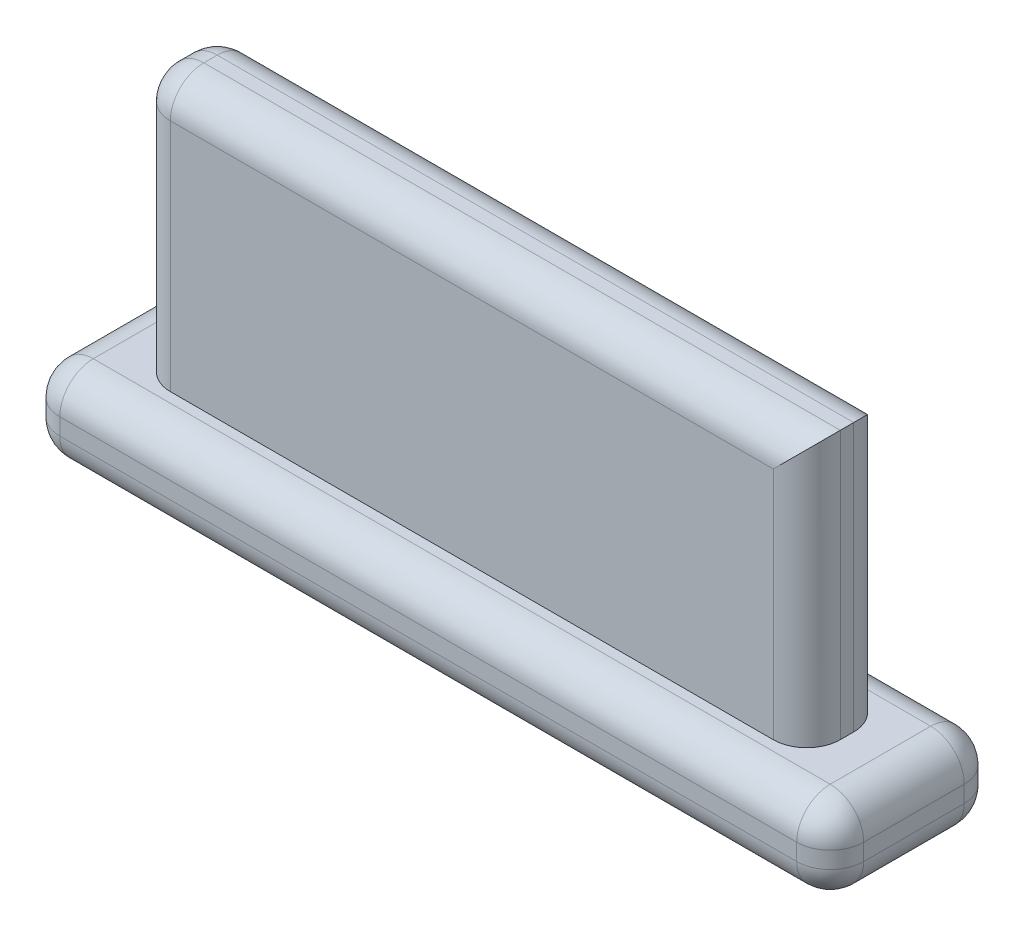
ISO-10303-21;
HEADER;
FILE_DESCRIPTION(('STEP AP214'),'2;1');
FILE_NAME('part.step','',(''),(''),'','','');
FILE_SCHEMA(('AUTOMOTIVE_DESIGN { 1 0 10303 214 1 1 1 1 }'));
ENDSEC;
DATA;
#1=APPLICATION_CONTEXT('core data for automotive mechanical design processes');
#2=APPLICATION_PROTOCOL_DEFINITION('international standard','automotive_design',2000,#1);
#3=PRODUCT_CONTEXT('',#1,'mechanical');
#4=PRODUCT('Part','Part','',(#3));
#5=PRODUCT_RELATED_PRODUCT_CATEGORY('part','',(#4));
#6=PRODUCT_DEFINITION_FORMATION('','',#4);
#7=PRODUCT_DEFINITION_CONTEXT('part definition',#1,'design');
#8=PRODUCT_DEFINITION('design','',#6,#7);
#9=PRODUCT_DEFINITION_SHAPE('','',#8);
#10=(LENGTH_UNIT() NAMED_UNIT(*) SI_UNIT(.MILLI.,.METRE.));
#11=(NAMED_UNIT(*) PLANE_ANGLE_UNIT() SI_UNIT($,.RADIAN.));
#12=(NAMED_UNIT(*) SI_UNIT($,.STERADIAN.) SOLID_ANGLE_UNIT());
#13=UNCERTAINTY_MEASURE_WITH_UNIT(LENGTH_MEASURE(1.E-05),#10,'distance_accuracy_value','');
#14=(GEOMETRIC_REPRESENTATION_CONTEXT(3) GLOBAL_UNCERTAINTY_ASSIGNED_CONTEXT((#13)) GLOBAL_UNIT_ASSIGNED_CONTEXT((#10,
#11,#12)) REPRESENTATION_CONTEXT('',''));
#15=CARTESIAN_POINT('',(0.,0.,0.));
#16=DIRECTION('',(0.,0.,1.));
#17=DIRECTION('',(1.,0.,0.));
#18=AXIS2_PLACEMENT_3D('',#15,#16,#17);
#19=CARTESIAN_POINT('',(12.7,10.16,1.524));
#20=DIRECTION('',(-1.,0.,0.));
#21=DIRECTION('',(0.,0.,1.));
#22=AXIS2_PLACEMENT_3D('',#19,#20,#21);
#23=PLANE('',#22);
#24=DIRECTION('',(0.,0.,-1.));
#25=VECTOR('',#24,1.);
#26=CARTESIAN_POINT('',(12.7,0.,1.524));
#27=LINE('',#26,#25);
#28=CARTESIAN_POINT('',(12.7,0.,0.254));
#29=VERTEX_POINT('',#28);
#30=CARTESIAN_POINT('',(12.7,0.,-0.254));
#31=VERTEX_POINT('',#30);
#32=EDGE_CURVE('E254',#29,#31,#27,.T.);
#33=ORIENTED_EDGE('',*,*,#32,.T.);
#34=DIRECTION('',(0.,-1.,0.));
#35=VECTOR('',#34,1.);
#36=CARTESIAN_POINT('',(12.7,10.16,-0.254));
#37=LINE('',#36,#35);
#38=CARTESIAN_POINT('',(12.7,10.16,-0.254));
#39=VERTEX_POINT('',#38);
#40=EDGE_CURVE('E383',#31,#39,#37,.F.);
#41=ORIENTED_EDGE('',*,*,#40,.T.);
#42=DIRECTION('',(0.,0.,-1.));
#43=VECTOR('',#42,1.);
#44=CARTESIAN_POINT('',(12.7,10.16,1.524));
#45=LINE('',#44,#43);
#46=CARTESIAN_POINT('',(12.7,10.16,0.254));
#47=VERTEX_POINT('',#46);
#48=EDGE_CURVE('E198',#47,#39,#45,.T.);
#49=ORIENTED_EDGE('',*,*,#48,.F.);
#50=DIRECTION('',(0.,-1.,0.));
#51=VECTOR('',#50,1.);
#52=CARTESIAN_POINT('',(12.7,10.16,0.254));
#53=LINE('',#52,#51);
#54=EDGE_CURVE('E381',#47,#29,#53,.T.);
#55=ORIENTED_EDGE('',*,*,#54,.T.);
#56=EDGE_LOOP('',(#33,#41,#49,#55));
#57=FACE_BOUND('',#56,.T.);
#58=ADVANCED_FACE('F33',(#57),#23,.F.);
#59=CARTESIAN_POINT('',(-12.7,10.16,-1.524));
#60=DIRECTION('',(0.,0.,1.));
#61=DIRECTION('',(1.,0.,0.));
#62=AXIS2_PLACEMENT_3D('',#59,#60,#61);
#63=PLANE('',#62);
#64=DIRECTION('',(-1.,0.,0.));
#65=VECTOR('',#64,1.);
#66=CARTESIAN_POINT('',(-12.7,0.,-1.524));
#67=LINE('',#66,#65);
#68=CARTESIAN_POINT('',(11.43,0.,-1.524));
#69=VERTEX_POINT('',#68);
#70=CARTESIAN_POINT('',(-11.43,0.,-1.524));
#71=VERTEX_POINT('',#70);
#72=EDGE_CURVE('E395',#69,#71,#67,.T.);
#73=ORIENTED_EDGE('',*,*,#72,.T.);
#74=DIRECTION('',(0.,-1.,0.));
#75=VECTOR('',#74,1.);
#76=CARTESIAN_POINT('',(-11.43,10.16,-1.524));
#77=LINE('',#76,#75);
#78=CARTESIAN_POINT('',(-11.43,8.89,-1.524));
#79=VERTEX_POINT('',#78);
#80=EDGE_CURVE('E55',#71,#79,#77,.F.);
#81=ORIENTED_EDGE('',*,*,#80,.T.);
#82=DIRECTION('',(-1.,0.,0.));
#83=VECTOR('',#82,1.);
#84=CARTESIAN_POINT('',(-12.7,8.89,-1.524));
#85=LINE('',#84,#83);
#86=CARTESIAN_POINT('',(11.43,8.89,-1.524));
#87=VERTEX_POINT('',#86);
#88=EDGE_CURVE('E50',#79,#87,#85,.F.);
#89=ORIENTED_EDGE('',*,*,#88,.T.);
#90=DIRECTION('',(0.,-1.,0.));
#91=VECTOR('',#90,1.);
#92=CARTESIAN_POINT('',(11.43,10.16,-1.524));
#93=LINE('',#92,#91);
#94=EDGE_CURVE('E378',#87,#69,#93,.T.);
#95=ORIENTED_EDGE('',*,*,#94,.T.);
#96=EDGE_LOOP('',(#73,#81,#89,#95));
#97=FACE_BOUND('',#96,.T.);
#98=ADVANCED_FACE('F459',(#97),#63,.F.);
#99=CARTESIAN_POINT('',(-12.7,10.16,1.524));
#100=DIRECTION('',(1.,0.,0.));
#101=DIRECTION('',(0.,0.,-1.));
#102=AXIS2_PLACEMENT_3D('',#99,#100,#101);
#103=PLANE('',#102);
#104=DIRECTION('',(0.,0.,1.));
#105=VECTOR('',#104,1.);
#106=CARTESIAN_POINT('',(-12.7,8.89,1.524));
#107=LINE('',#106,#105);
#108=CARTESIAN_POINT('',(-12.7,8.89,0.254));
#109=VERTEX_POINT('',#108);
#110=CARTESIAN_POINT('',(-12.7,8.89,-0.254));
#111=VERTEX_POINT('',#110);
#112=EDGE_CURVE('E371',#109,#111,#107,.F.);
#113=ORIENTED_EDGE('',*,*,#112,.T.);
#114=DIRECTION('',(0.,-1.,0.));
#115=VECTOR('',#114,1.);
#116=CARTESIAN_POINT('',(-12.7,10.16,-0.254));
#117=LINE('',#116,#115);
#118=CARTESIAN_POINT('',(-12.7,0.,-0.254));
#119=VERTEX_POINT('',#118);
#120=EDGE_CURVE('E375',#111,#119,#117,.T.);
#121=ORIENTED_EDGE('',*,*,#120,.T.);
#122=DIRECTION('',(0.,0.,1.));
#123=VECTOR('',#122,1.);
#124=CARTESIAN_POINT('',(-12.7,0.,1.524));
#125=LINE('',#124,#123);
#126=CARTESIAN_POINT('',(-12.7,0.,0.254));
#127=VERTEX_POINT('',#126);
#128=EDGE_CURVE('E413',#119,#127,#125,.T.);
#129=ORIENTED_EDGE('',*,*,#128,.T.);
#130=DIRECTION('',(0.,-1.,0.));
#131=VECTOR('',#130,1.);
#132=CARTESIAN_POINT('',(-12.7,10.16,0.254));
#133=LINE('',#132,#131);
#134=EDGE_CURVE('E373',#127,#109,#133,.F.);
#135=ORIENTED_EDGE('',*,*,#134,.T.);
#136=EDGE_LOOP('',(#113,#121,#129,#135));
#137=FACE_BOUND('',#136,.T.);
#138=ADVANCED_FACE('F464',(#137),#103,.F.);
#139=CARTESIAN_POINT('',(-12.7,10.16,1.524));
#140=DIRECTION('',(0.,0.,-1.));
#141=DIRECTION('',(-1.,0.,0.));
#142=AXIS2_PLACEMENT_3D('',#139,#140,#141);
#143=PLANE('',#142);
#144=DIRECTION('',(1.,0.,0.));
#145=VECTOR('',#144,1.);
#146=CARTESIAN_POINT('',(-12.7,8.89,1.524));
#147=LINE('',#146,#145);
#148=CARTESIAN_POINT('',(11.43,8.89,1.524));
#149=VERTEX_POINT('',#148);
#150=CARTESIAN_POINT('',(-11.43,8.89,1.524));
#151=VERTEX_POINT('',#150);
#152=EDGE_CURVE('E367',#149,#151,#147,.F.);
#153=ORIENTED_EDGE('',*,*,#152,.T.);
#154=DIRECTION('',(0.,-1.,0.));
#155=VECTOR('',#154,1.);
#156=CARTESIAN_POINT('',(-11.43,10.16,1.524));
#157=LINE('',#156,#155);
#158=CARTESIAN_POINT('',(-11.43,0.,1.524));
#159=VERTEX_POINT('',#158);
#160=EDGE_CURVE('E369',#151,#159,#157,.T.);
#161=ORIENTED_EDGE('',*,*,#160,.T.);
#162=DIRECTION('',(1.,0.,0.));
#163=VECTOR('',#162,1.);
#164=CARTESIAN_POINT('',(-12.7,0.,1.524));
#165=LINE('',#164,#163);
#166=CARTESIAN_POINT('',(11.43,0.,1.524));
#167=VERTEX_POINT('',#166);
#168=EDGE_CURVE('E410',#159,#167,#165,.T.);
#169=ORIENTED_EDGE('',*,*,#168,.T.);
#170=DIRECTION('',(0.,-1.,0.));
#171=VECTOR('',#170,1.);
#172=CARTESIAN_POINT('',(11.43,10.16,1.524));
#173=LINE('',#172,#171);
#174=EDGE_CURVE('E365',#167,#149,#173,.F.);
#175=ORIENTED_EDGE('',*,*,#174,.T.);
#176=EDGE_LOOP('',(#153,#161,#169,#175));
#177=FACE_BOUND('',#176,.T.);
#178=ADVANCED_FACE('F469',(#177),#143,.F.);
#179=CARTESIAN_POINT('',(0.,10.16,0.));
#180=DIRECTION('',(0.,-1.,0.));
#181=DIRECTION('',(0.,0.,-1.));
#182=AXIS2_PLACEMENT_3D('',#179,#180,#181);
#183=PLANE('',#182);
#184=DIRECTION('',(0.,0.,1.));
#185=VECTOR('',#184,1.);
#186=CARTESIAN_POINT('',(-11.43,10.16,0.));
#187=LINE('',#186,#185);
#188=CARTESIAN_POINT('',(-11.43,10.16,-0.254));
#189=VERTEX_POINT('',#188);
#190=CARTESIAN_POINT('',(-11.43,10.16,0.254));
#191=VERTEX_POINT('',#190);
#192=EDGE_CURVE('E358',#189,#191,#187,.T.);
#193=ORIENTED_EDGE('',*,*,#192,.T.);
#194=DIRECTION('',(1.,0.,0.));
#195=VECTOR('',#194,1.);
#196=CARTESIAN_POINT('',(0.,10.16,0.254));
#197=LINE('',#196,#195);
#198=EDGE_CURVE('E362',#191,#47,#197,.T.);
#199=ORIENTED_EDGE('',*,*,#198,.T.);
#200=ORIENTED_EDGE('',*,*,#48,.T.);
#201=DIRECTION('',(-1.,0.,0.));
#202=VECTOR('',#201,1.);
#203=CARTESIAN_POINT('',(0.,10.16,-0.254));
#204=LINE('',#203,#202);
#205=EDGE_CURVE('E360',#39,#189,#204,.T.);
#206=ORIENTED_EDGE('',*,*,#205,.T.);
#207=EDGE_LOOP('',(#193,#199,#200,#206));
#208=FACE_BOUND('',#207,.T.);
#209=ADVANCED_FACE('F406',(#208),#183,.F.);
#210=CARTESIAN_POINT('',(15.24,-3.175,3.175));
#211=DIRECTION('',(-1.,0.,0.));
#212=DIRECTION('',(0.,0.,1.));
#213=AXIS2_PLACEMENT_3D('',#210,#211,#212);
#214=PLANE('',#213);
#215=DIRECTION('',(0.,1.,0.));
#216=VECTOR('',#215,1.);
#217=CARTESIAN_POINT('',(15.24,-3.175,1.905));
#218=LINE('',#217,#216);
#219=CARTESIAN_POINT('',(15.24,-1.27,1.905));
#220=VERTEX_POINT('',#219);
#221=CARTESIAN_POINT('',(15.24,-1.905,1.905));
#222=VERTEX_POINT('',#221);
#223=EDGE_CURVE('E336',#220,#222,#218,.F.);
#224=ORIENTED_EDGE('',*,*,#223,.T.);
#225=DIRECTION('',(0.,0.,1.));
#226=VECTOR('',#225,1.);
#227=CARTESIAN_POINT('',(15.24,-1.905,-3.175));
#228=LINE('',#227,#226);
#229=CARTESIAN_POINT('',(15.24,-1.905,-1.905));
#230=VERTEX_POINT('',#229);
#231=EDGE_CURVE('E338',#222,#230,#228,.F.);
#232=ORIENTED_EDGE('',*,*,#231,.T.);
#233=DIRECTION('',(0.,1.,0.));
#234=VECTOR('',#233,1.);
#235=CARTESIAN_POINT('',(15.24,-3.175,-1.905));
#236=LINE('',#235,#234);
#237=CARTESIAN_POINT('',(15.24,-1.27,-1.905));
#238=VERTEX_POINT('',#237);
#239=EDGE_CURVE('E332',#230,#238,#236,.T.);
#240=ORIENTED_EDGE('',*,*,#239,.T.);
#241=DIRECTION('',(0.,0.,1.));
#242=VECTOR('',#241,1.);
#243=CARTESIAN_POINT('',(15.24,-1.27,3.175));
#244=LINE('',#243,#242);
#245=EDGE_CURVE('E334',#238,#220,#244,.T.);
#246=ORIENTED_EDGE('',*,*,#245,.T.);
#247=EDGE_LOOP('',(#224,#232,#240,#246));
#248=FACE_BOUND('',#247,.T.);
#249=ADVANCED_FACE('F425',(#248),#214,.F.);
#250=CARTESIAN_POINT('',(-15.24,-3.175,3.175));
#251=DIRECTION('',(0.,0.,-1.));
#252=DIRECTION('',(-1.,0.,0.));
#253=AXIS2_PLACEMENT_3D('',#250,#251,#252);
#254=PLANE('',#253);
#255=DIRECTION('',(-1.,0.,0.));
#256=VECTOR('',#255,1.);
#257=CARTESIAN_POINT('',(15.24,-1.905,3.175));
#258=LINE('',#257,#256);
#259=CARTESIAN_POINT('',(-13.97,-1.905,3.175));
#260=VERTEX_POINT('',#259);
#261=CARTESIAN_POINT('',(13.97,-1.905,3.175));
#262=VERTEX_POINT('',#261);
#263=EDGE_CURVE('E313',#260,#262,#258,.F.);
#264=ORIENTED_EDGE('',*,*,#263,.T.);
#265=DIRECTION('',(0.,1.,0.));
#266=VECTOR('',#265,1.);
#267=CARTESIAN_POINT('',(13.97,-3.175,3.175));
#268=LINE('',#267,#266);
#269=CARTESIAN_POINT('',(13.97,-1.27,3.175));
#270=VERTEX_POINT('',#269);
#271=EDGE_CURVE('E306',#262,#270,#268,.T.);
#272=ORIENTED_EDGE('',*,*,#271,.T.);
#273=DIRECTION('',(-1.,0.,0.));
#274=VECTOR('',#273,1.);
#275=CARTESIAN_POINT('',(-15.24,-1.27,3.175));
#276=LINE('',#275,#274);
#277=CARTESIAN_POINT('',(-13.97,-1.27,3.175));
#278=VERTEX_POINT('',#277);
#279=EDGE_CURVE('E319',#270,#278,#276,.T.);
#280=ORIENTED_EDGE('',*,*,#279,.T.);
#281=DIRECTION('',(0.,1.,0.));
#282=VECTOR('',#281,1.);
#283=CARTESIAN_POINT('',(-13.97,-3.175,3.175));
#284=LINE('',#283,#282);
#285=EDGE_CURVE('E317',#278,#260,#284,.F.);
#286=ORIENTED_EDGE('',*,*,#285,.T.);
#287=EDGE_LOOP('',(#264,#272,#280,#286));
#288=FACE_BOUND('',#287,.T.);
#289=ADVANCED_FACE('F315',(#288),#254,.F.);
#290=CARTESIAN_POINT('',(-15.24,-3.175,3.175));
#291=DIRECTION('',(1.,0.,0.));
#292=DIRECTION('',(0.,0.,-1.));
#293=AXIS2_PLACEMENT_3D('',#290,#291,#292);
#294=PLANE('',#293);
#295=DIRECTION('',(0.,0.,-1.));
#296=VECTOR('',#295,1.);
#297=CARTESIAN_POINT('',(-15.24,-1.905,3.175));
#298=LINE('',#297,#296);
#299=CARTESIAN_POINT('',(-15.24,-1.905,-1.905));
#300=VERTEX_POINT('',#299);
#301=CARTESIAN_POINT('',(-15.24,-1.905,1.905));
#302=VERTEX_POINT('',#301);
#303=EDGE_CURVE('E209',#300,#302,#298,.F.);
#304=ORIENTED_EDGE('',*,*,#303,.T.);
#305=DIRECTION('',(0.,1.,0.));
#306=VECTOR('',#305,1.);
#307=CARTESIAN_POINT('',(-15.24,-3.175,1.905));
#308=LINE('',#307,#306);
#309=CARTESIAN_POINT('',(-15.24,-1.27,1.905));
#310=VERTEX_POINT('',#309);
#311=EDGE_CURVE('E346',#302,#310,#308,.T.);
#312=ORIENTED_EDGE('',*,*,#311,.T.);
#313=DIRECTION('',(0.,0.,-1.));
#314=VECTOR('',#313,1.);
#315=CARTESIAN_POINT('',(-15.24,-1.27,3.175));
#316=LINE('',#315,#314);
#317=CARTESIAN_POINT('',(-15.24,-1.27,-1.905));
#318=VERTEX_POINT('',#317);
#319=EDGE_CURVE('E343',#310,#318,#316,.T.);
#320=ORIENTED_EDGE('',*,*,#319,.T.);
#321=DIRECTION('',(0.,1.,0.));
#322=VECTOR('',#321,1.);
#323=CARTESIAN_POINT('',(-15.24,-3.175,-1.905));
#324=LINE('',#323,#322);
#325=EDGE_CURVE('E341',#318,#300,#324,.F.);
#326=ORIENTED_EDGE('',*,*,#325,.T.);
#327=EDGE_LOOP('',(#304,#312,#320,#326));
#328=FACE_BOUND('',#327,.T.);
#329=ADVANCED_FACE('F480',(#328),#294,.F.);
#330=CARTESIAN_POINT('',(-15.24,-3.175,-3.175));
#331=DIRECTION('',(0.,0.,1.));
#332=DIRECTION('',(1.,0.,0.));
#333=AXIS2_PLACEMENT_3D('',#330,#331,#332);
#334=PLANE('',#333);
#335=DIRECTION('',(1.,0.,0.));
#336=VECTOR('',#335,1.);
#337=CARTESIAN_POINT('',(-15.24,-1.905,-3.175));
#338=LINE('',#337,#336);
#339=CARTESIAN_POINT('',(13.97,-1.905,-3.175));
#340=VERTEX_POINT('',#339);
#341=CARTESIAN_POINT('',(-13.97,-1.905,-3.175));
#342=VERTEX_POINT('',#341);
#343=EDGE_CURVE('E353',#340,#342,#338,.F.);
#344=ORIENTED_EDGE('',*,*,#343,.T.);
#345=DIRECTION('',(0.,1.,0.));
#346=VECTOR('',#345,1.);
#347=CARTESIAN_POINT('',(-13.97,-3.175,-3.175));
#348=LINE('',#347,#346);
#349=CARTESIAN_POINT('',(-13.97,-1.27,-3.175));
#350=VERTEX_POINT('',#349);
#351=EDGE_CURVE('E355',#342,#350,#348,.T.);
#352=ORIENTED_EDGE('',*,*,#351,.T.);
#353=DIRECTION('',(1.,0.,0.));
#354=VECTOR('',#353,1.);
#355=CARTESIAN_POINT('',(-15.24,-1.27,-3.175));
#356=LINE('',#355,#354);
#357=CARTESIAN_POINT('',(13.97,-1.27,-3.175));
#358=VERTEX_POINT('',#357);
#359=EDGE_CURVE('E349',#350,#358,#356,.T.);
#360=ORIENTED_EDGE('',*,*,#359,.T.);
#361=DIRECTION('',(0.,1.,0.));
#362=VECTOR('',#361,1.);
#363=CARTESIAN_POINT('',(13.97,-3.175,-3.175));
#364=LINE('',#363,#362);
#365=EDGE_CURVE('E351',#358,#340,#364,.F.);
#366=ORIENTED_EDGE('',*,*,#365,.T.);
#367=EDGE_LOOP('',(#344,#352,#360,#366));
#368=FACE_BOUND('',#367,.T.);
#369=ADVANCED_FACE('F483',(#368),#334,.F.);
#370=CARTESIAN_POINT('',(0.,-3.175,0.));
#371=DIRECTION('',(0.,-1.,0.));
#372=DIRECTION('',(0.,0.,-1.));
#373=AXIS2_PLACEMENT_3D('',#370,#371,#372);
#374=PLANE('',#373);
#375=DIRECTION('',(0.,0.,1.));
#376=VECTOR('',#375,1.);
#377=CARTESIAN_POINT('',(13.97,-3.175,3.175));
#378=LINE('',#377,#376);
#379=CARTESIAN_POINT('',(13.97,-3.175,-1.905));
#380=VERTEX_POINT('',#379);
#381=CARTESIAN_POINT('',(13.97,-3.175,1.905));
#382=VERTEX_POINT('',#381);
#383=EDGE_CURVE('E186',#380,#382,#378,.T.);
#384=ORIENTED_EDGE('',*,*,#383,.T.);
#385=DIRECTION('',(-1.,0.,0.));
#386=VECTOR('',#385,1.);
#387=CARTESIAN_POINT('',(-15.24,-3.175,1.905));
#388=LINE('',#387,#386);
#389=CARTESIAN_POINT('',(-13.97,-3.175,1.905));
#390=VERTEX_POINT('',#389);
#391=EDGE_CURVE('E182',#382,#390,#388,.T.);
#392=ORIENTED_EDGE('',*,*,#391,.T.);
#393=DIRECTION('',(0.,0.,-1.));
#394=VECTOR('',#393,1.);
#395=CARTESIAN_POINT('',(-13.97,-3.175,-3.175));
#396=LINE('',#395,#394);
#397=CARTESIAN_POINT('',(-13.97,-3.175,-1.905));
#398=VERTEX_POINT('',#397);
#399=EDGE_CURVE('E176',#390,#398,#396,.T.);
#400=ORIENTED_EDGE('',*,*,#399,.T.);
#401=DIRECTION('',(1.,0.,0.));
#402=VECTOR('',#401,1.);
#403=CARTESIAN_POINT('',(15.24,-3.175,-1.905));
#404=LINE('',#403,#402);
#405=EDGE_CURVE('E179',#398,#380,#404,.T.);
#406=ORIENTED_EDGE('',*,*,#405,.T.);
#407=EDGE_LOOP('',(#384,#392,#400,#406));
#408=FACE_BOUND('',#407,.T.);
#409=ADVANCED_FACE('F178',(#408),#374,.T.);
#410=CARTESIAN_POINT('',(0.,0.,0.));
#411=DIRECTION('',(0.,-1.,0.));
#412=DIRECTION('',(0.,0.,-1.));
#413=AXIS2_PLACEMENT_3D('',#410,#411,#412);
#414=PLANE('',#413);
#415=DIRECTION('',(0.,0.,-1.));
#416=VECTOR('',#415,1.);
#417=CARTESIAN_POINT('',(-13.97,0.,0.));
#418=LINE('',#417,#416);
#419=CARTESIAN_POINT('',(-13.97,0.,-1.905));
#420=VERTEX_POINT('',#419);
#421=CARTESIAN_POINT('',(-13.97,0.,1.905));
#422=VERTEX_POINT('',#421);
#423=EDGE_CURVE('E325',#420,#422,#418,.F.);
#424=ORIENTED_EDGE('',*,*,#423,.T.);
#425=DIRECTION('',(-1.,0.,0.));
#426=VECTOR('',#425,1.);
#427=CARTESIAN_POINT('',(0.,0.,1.905));
#428=LINE('',#427,#426);
#429=CARTESIAN_POINT('',(13.97,0.,1.905));
#430=VERTEX_POINT('',#429);
#431=EDGE_CURVE('E329',#422,#430,#428,.F.);
#432=ORIENTED_EDGE('',*,*,#431,.T.);
#433=DIRECTION('',(0.,0.,1.));
#434=VECTOR('',#433,1.);
#435=CARTESIAN_POINT('',(13.97,0.,0.));
#436=LINE('',#435,#434);
#437=CARTESIAN_POINT('',(13.97,0.,-1.905));
#438=VERTEX_POINT('',#437);
#439=EDGE_CURVE('E327',#430,#438,#436,.F.);
#440=ORIENTED_EDGE('',*,*,#439,.T.);
#441=DIRECTION('',(1.,0.,0.));
#442=VECTOR('',#441,1.);
#443=CARTESIAN_POINT('',(0.,0.,-1.905));
#444=LINE('',#443,#442);
#445=EDGE_CURVE('E312',#438,#420,#444,.F.);
#446=ORIENTED_EDGE('',*,*,#445,.T.);
#447=EDGE_LOOP('',(#424,#432,#440,#446));
#448=FACE_BOUND('',#447,.T.);
#449=ORIENTED_EDGE('',*,*,#32,.F.);
#450=CARTESIAN_POINT('',(11.43,0.,0.254));
#451=DIRECTION('',(0.,-1.,0.));
#452=DIRECTION('',(0.,0.,-1.));
#453=AXIS2_PLACEMENT_3D('',#450,#451,#452);
#454=CIRCLE('',#453,1.27);
#455=EDGE_CURVE('E11',#29,#167,#454,.T.);
#456=ORIENTED_EDGE('',*,*,#455,.T.);
#457=ORIENTED_EDGE('',*,*,#168,.F.);
#458=CARTESIAN_POINT('',(-11.43,0.,0.254));
#459=DIRECTION('',(0.,-1.,0.));
#460=DIRECTION('',(0.,0.,-1.));
#461=AXIS2_PLACEMENT_3D('',#458,#459,#460);
#462=CIRCLE('',#461,1.27);
#463=EDGE_CURVE('E387',#159,#127,#462,.T.);
#464=ORIENTED_EDGE('',*,*,#463,.T.);
#465=ORIENTED_EDGE('',*,*,#128,.F.);
#466=CARTESIAN_POINT('',(-11.43,0.,-0.254));
#467=DIRECTION('',(0.,-1.,0.));
#468=DIRECTION('',(0.,0.,-1.));
#469=AXIS2_PLACEMENT_3D('',#466,#467,#468);
#470=CIRCLE('',#469,1.27);
#471=EDGE_CURVE('E385',#119,#71,#470,.T.);
#472=ORIENTED_EDGE('',*,*,#471,.T.);
#473=ORIENTED_EDGE('',*,*,#72,.F.);
#474=CARTESIAN_POINT('',(11.43,0.,-0.254));
#475=DIRECTION('',(0.,-1.,0.));
#476=DIRECTION('',(0.,0.,-1.));
#477=AXIS2_PLACEMENT_3D('',#474,#475,#476);
#478=CIRCLE('',#477,1.27);
#479=EDGE_CURVE('E42',#69,#31,#478,.T.);
#480=ORIENTED_EDGE('',*,*,#479,.T.);
#481=EDGE_LOOP('',(#449,#456,#457,#464,#465,#472,#473,#480));
#482=FACE_BOUND('',#481,.T.);
#483=ADVANCED_FACE('F393',(#448,#482),#414,.F.);
#484=CARTESIAN_POINT('',(-15.24,-1.27,-1.905));
#485=DIRECTION('',(1.,0.,0.));
#486=DIRECTION('',(0.,0.,-1.));
#487=AXIS2_PLACEMENT_3D('',#484,#485,#486);
#488=CYLINDRICAL_SURFACE('',#487,1.27);
#489=CARTESIAN_POINT('',(13.97,-1.27,-1.905));
#490=DIRECTION('',(1.,0.,0.));
#491=DIRECTION('',(0.,0.,-1.));
#492=AXIS2_PLACEMENT_3D('',#489,#490,#491);
#493=CIRCLE('',#492,1.27);
#494=EDGE_CURVE('E251',#358,#438,#493,.T.);
#495=ORIENTED_EDGE('',*,*,#494,.F.);
#496=ORIENTED_EDGE('',*,*,#359,.F.);
#497=CARTESIAN_POINT('',(-13.97,-1.27,-1.905));
#498=DIRECTION('',(-1.,0.,0.));
#499=DIRECTION('',(0.,0.,1.));
#500=AXIS2_PLACEMENT_3D('',#497,#498,#499);
#501=CIRCLE('',#500,1.27);
#502=EDGE_CURVE('E248',#420,#350,#501,.T.);
#503=ORIENTED_EDGE('',*,*,#502,.F.);
#504=ORIENTED_EDGE('',*,*,#445,.F.);
#505=EDGE_LOOP('',(#495,#496,#503,#504));
#506=FACE_BOUND('',#505,.T.);
#507=ADVANCED_FACE('F490',(#506),#488,.T.);
#508=CARTESIAN_POINT('',(13.97,-1.27,-1.905));
#509=DIRECTION('',(0.,1.,0.));
#510=DIRECTION('',(0.,0.,1.));
#511=AXIS2_PLACEMENT_3D('',#508,#509,#510);
#512=SPHERICAL_SURFACE('',#511,1.27);
#513=CARTESIAN_POINT('',(13.97,-1.27,-1.905));
#514=DIRECTION('',(0.,1.,0.));
#515=DIRECTION('',(0.,0.,1.));
#516=AXIS2_PLACEMENT_3D('',#513,#514,#515);
#517=CIRCLE('',#516,1.27);
#518=EDGE_CURVE('E242',#358,#238,#517,.F.);
#519=ORIENTED_EDGE('',*,*,#518,.F.);
#520=ORIENTED_EDGE('',*,*,#494,.T.);
#521=CARTESIAN_POINT('',(13.97,-1.27,-1.905));
#522=DIRECTION('',(0.,0.,-1.));
#523=DIRECTION('',(-1.,0.,0.));
#524=AXIS2_PLACEMENT_3D('',#521,#522,#523);
#525=CIRCLE('',#524,1.27);
#526=EDGE_CURVE('E245',#238,#438,#525,.F.);
#527=ORIENTED_EDGE('',*,*,#526,.F.);
#528=EDGE_LOOP('',(#519,#520,#527));
#529=FACE_BOUND('',#528,.T.);
#530=ADVANCED_FACE('F507',(#529),#512,.T.);
#531=CARTESIAN_POINT('',(-13.97,-1.27,-1.905));
#532=DIRECTION('',(0.,0.,-1.));
#533=DIRECTION('',(-1.,0.,0.));
#534=AXIS2_PLACEMENT_3D('',#531,#532,#533);
#535=SPHERICAL_SURFACE('',#534,1.27);
#536=CARTESIAN_POINT('',(-13.97,-1.27,-1.905));
#537=DIRECTION('',(0.,0.,-1.));
#538=DIRECTION('',(-1.,0.,0.));
#539=AXIS2_PLACEMENT_3D('',#536,#537,#538);
#540=CIRCLE('',#539,1.27);
#541=EDGE_CURVE('E237',#420,#318,#540,.F.);
#542=ORIENTED_EDGE('',*,*,#541,.F.);
#543=ORIENTED_EDGE('',*,*,#502,.T.);
#544=CARTESIAN_POINT('',(-13.97,-1.27,-1.905));
#545=DIRECTION('',(0.,1.,0.));
#546=DIRECTION('',(0.,0.,1.));
#547=AXIS2_PLACEMENT_3D('',#544,#545,#546);
#548=CIRCLE('',#547,1.27);
#549=EDGE_CURVE('E240',#318,#350,#548,.F.);
#550=ORIENTED_EDGE('',*,*,#549,.F.);
#551=EDGE_LOOP('',(#542,#543,#550));
#552=FACE_BOUND('',#551,.T.);
#553=ADVANCED_FACE('F515',(#552),#535,.T.);
#554=CARTESIAN_POINT('',(13.97,-1.27,3.175));
#555=DIRECTION('',(0.,0.,1.));
#556=DIRECTION('',(1.,0.,0.));
#557=AXIS2_PLACEMENT_3D('',#554,#555,#556);
#558=CYLINDRICAL_SURFACE('',#557,1.27);
#559=ORIENTED_EDGE('',*,*,#526,.T.);
#560=ORIENTED_EDGE('',*,*,#439,.F.);
#561=CARTESIAN_POINT('',(13.97,-1.27,1.905));
#562=DIRECTION('',(0.,0.,1.));
#563=DIRECTION('',(1.,0.,0.));
#564=AXIS2_PLACEMENT_3D('',#561,#562,#563);
#565=CIRCLE('',#564,1.27);
#566=EDGE_CURVE('E232',#220,#430,#565,.T.);
#567=ORIENTED_EDGE('',*,*,#566,.F.);
#568=ORIENTED_EDGE('',*,*,#245,.F.);
#569=EDGE_LOOP('',(#559,#560,#567,#568));
#570=FACE_BOUND('',#569,.T.);
#571=ADVANCED_FACE('F431',(#570),#558,.T.);
#572=CARTESIAN_POINT('',(13.97,-3.175,-1.905));
#573=DIRECTION('',(0.,1.,0.));
#574=DIRECTION('',(0.,0.,1.));
#575=AXIS2_PLACEMENT_3D('',#572,#573,#574);
#576=CYLINDRICAL_SURFACE('',#575,1.27);
#577=ORIENTED_EDGE('',*,*,#518,.T.);
#578=ORIENTED_EDGE('',*,*,#239,.F.);
#579=CARTESIAN_POINT('',(13.97,-1.905,-1.905));
#580=DIRECTION('',(0.,-1.,0.));
#581=DIRECTION('',(0.,0.,-1.));
#582=AXIS2_PLACEMENT_3D('',#579,#580,#581);
#583=CIRCLE('',#582,1.27);
#584=EDGE_CURVE('E229',#340,#230,#583,.T.);
#585=ORIENTED_EDGE('',*,*,#584,.F.);
#586=ORIENTED_EDGE('',*,*,#365,.F.);
#587=EDGE_LOOP('',(#577,#578,#585,#586));
#588=FACE_BOUND('',#587,.T.);
#589=ADVANCED_FACE('F530',(#588),#576,.T.);
#590=CARTESIAN_POINT('',(0.,-1.905,-1.905));
#591=DIRECTION('',(-1.,0.,0.));
#592=DIRECTION('',(0.,0.,1.));
#593=AXIS2_PLACEMENT_3D('',#590,#591,#592);
#594=CYLINDRICAL_SURFACE('',#593,1.27);
#595=CARTESIAN_POINT('',(-13.97,-1.905,-1.905));
#596=DIRECTION('',(-1.,0.,0.));
#597=DIRECTION('',(0.,0.,1.));
#598=AXIS2_PLACEMENT_3D('',#595,#596,#597);
#599=CIRCLE('',#598,1.27);
#600=EDGE_CURVE('E193',#342,#398,#599,.T.);
#601=ORIENTED_EDGE('',*,*,#600,.F.);
#602=ORIENTED_EDGE('',*,*,#343,.F.);
#603=CARTESIAN_POINT('',(13.97,-1.905,-1.905));
#604=DIRECTION('',(1.,0.,0.));
#605=DIRECTION('',(0.,0.,-1.));
#606=AXIS2_PLACEMENT_3D('',#603,#604,#605);
#607=CIRCLE('',#606,1.27);
#608=EDGE_CURVE('E196',#380,#340,#607,.T.);
#609=ORIENTED_EDGE('',*,*,#608,.F.);
#610=ORIENTED_EDGE('',*,*,#405,.F.);
#611=EDGE_LOOP('',(#601,#602,#609,#610));
#612=FACE_BOUND('',#611,.T.);
#613=ADVANCED_FACE('F191',(#612),#594,.T.);
#614=CARTESIAN_POINT('',(-13.97,-3.175,-1.905));
#615=DIRECTION('',(0.,1.,0.));
#616=DIRECTION('',(0.,0.,1.));
#617=AXIS2_PLACEMENT_3D('',#614,#615,#616);
#618=CYLINDRICAL_SURFACE('',#617,1.27);
#619=ORIENTED_EDGE('',*,*,#549,.T.);
#620=ORIENTED_EDGE('',*,*,#351,.F.);
#621=CARTESIAN_POINT('',(-13.97,-1.905,-1.905));
#622=DIRECTION('',(0.,-1.,0.));
#623=DIRECTION('',(0.,0.,-1.));
#624=AXIS2_PLACEMENT_3D('',#621,#622,#623);
#625=CIRCLE('',#624,1.27);
#626=EDGE_CURVE('E206',#300,#342,#625,.T.);
#627=ORIENTED_EDGE('',*,*,#626,.F.);
#628=ORIENTED_EDGE('',*,*,#325,.F.);
#629=EDGE_LOOP('',(#619,#620,#627,#628));
#630=FACE_BOUND('',#629,.T.);
#631=ADVANCED_FACE('F544',(#630),#618,.T.);
#632=CARTESIAN_POINT('',(-13.97,-1.27,3.175));
#633=DIRECTION('',(0.,0.,-1.));
#634=DIRECTION('',(-1.,0.,0.));
#635=AXIS2_PLACEMENT_3D('',#632,#633,#634);
#636=CYLINDRICAL_SURFACE('',#635,1.27);
#637=ORIENTED_EDGE('',*,*,#541,.T.);
#638=ORIENTED_EDGE('',*,*,#319,.F.);
#639=CARTESIAN_POINT('',(-13.97,-1.27,1.905));
#640=DIRECTION('',(0.,0.,1.));
#641=DIRECTION('',(1.,0.,0.));
#642=AXIS2_PLACEMENT_3D('',#639,#640,#641);
#643=CIRCLE('',#642,1.27);
#644=EDGE_CURVE('E224',#422,#310,#643,.T.);
#645=ORIENTED_EDGE('',*,*,#644,.F.);
#646=ORIENTED_EDGE('',*,*,#423,.F.);
#647=EDGE_LOOP('',(#637,#638,#645,#646));
#648=FACE_BOUND('',#647,.T.);
#649=ADVANCED_FACE('F551',(#648),#636,.T.);
#650=CARTESIAN_POINT('',(-15.24,-1.27,1.905));
#651=DIRECTION('',(-1.,0.,0.));
#652=DIRECTION('',(0.,0.,1.));
#653=AXIS2_PLACEMENT_3D('',#650,#651,#652);
#654=CYLINDRICAL_SURFACE('',#653,1.27);
#655=CARTESIAN_POINT('',(13.97,-1.27,1.905));
#656=DIRECTION('',(1.,0.,0.));
#657=DIRECTION('',(0.,0.,-1.));
#658=AXIS2_PLACEMENT_3D('',#655,#656,#657);
#659=CIRCLE('',#658,1.27);
#660=EDGE_CURVE('E234',#430,#270,#659,.T.);
#661=ORIENTED_EDGE('',*,*,#660,.F.);
#662=ORIENTED_EDGE('',*,*,#431,.F.);
#663=CARTESIAN_POINT('',(-13.97,-1.27,1.905));
#664=DIRECTION('',(-1.,0.,0.));
#665=DIRECTION('',(0.,0.,1.));
#666=AXIS2_PLACEMENT_3D('',#663,#664,#665);
#667=CIRCLE('',#666,1.27);
#668=EDGE_CURVE('E221',#278,#422,#667,.T.);
#669=ORIENTED_EDGE('',*,*,#668,.F.);
#670=ORIENTED_EDGE('',*,*,#279,.F.);
#671=EDGE_LOOP('',(#661,#662,#669,#670));
#672=FACE_BOUND('',#671,.T.);
#673=ADVANCED_FACE('F437',(#672),#654,.T.);
#674=CARTESIAN_POINT('',(13.97,-1.27,1.905));
#675=DIRECTION('',(0.,1.,0.));
#676=DIRECTION('',(0.,0.,1.));
#677=AXIS2_PLACEMENT_3D('',#674,#675,#676);
#678=SPHERICAL_SURFACE('',#677,1.27);
#679=ORIENTED_EDGE('',*,*,#566,.T.);
#680=ORIENTED_EDGE('',*,*,#660,.T.);
#681=CARTESIAN_POINT('',(13.97,-1.27,1.905));
#682=DIRECTION('',(0.,1.,0.));
#683=DIRECTION('',(0.,0.,1.));
#684=AXIS2_PLACEMENT_3D('',#681,#682,#683);
#685=CIRCLE('',#684,1.27);
#686=EDGE_CURVE('E213',#220,#270,#685,.F.);
#687=ORIENTED_EDGE('',*,*,#686,.F.);
#688=EDGE_LOOP('',(#679,#680,#687));
#689=FACE_BOUND('',#688,.T.);
#690=ADVANCED_FACE('F434',(#689),#678,.T.);
#691=CARTESIAN_POINT('',(13.97,-1.905,-1.905));
#692=DIRECTION('',(0.,0.,-1.));
#693=DIRECTION('',(-1.,0.,0.));
#694=AXIS2_PLACEMENT_3D('',#691,#692,#693);
#695=SPHERICAL_SURFACE('',#694,1.27);
#696=ORIENTED_EDGE('',*,*,#608,.T.);
#697=ORIENTED_EDGE('',*,*,#584,.T.);
#698=CARTESIAN_POINT('',(13.97,-1.905,-1.905));
#699=DIRECTION('',(0.,0.,-1.));
#700=DIRECTION('',(0.,1.,0.));
#701=AXIS2_PLACEMENT_3D('',#698,#699,#700);
#702=CIRCLE('',#701,1.27);
#703=EDGE_CURVE('E210',#380,#230,#702,.F.);
#704=ORIENTED_EDGE('',*,*,#703,.F.);
#705=EDGE_LOOP('',(#696,#697,#704));
#706=FACE_BOUND('',#705,.T.);
#707=ADVANCED_FACE('F572',(#706),#695,.T.);
#708=CARTESIAN_POINT('',(-13.97,-1.905,-1.905));
#709=DIRECTION('',(0.,0.,-1.));
#710=DIRECTION('',(-1.,0.,0.));
#711=AXIS2_PLACEMENT_3D('',#708,#709,#710);
#712=SPHERICAL_SURFACE('',#711,1.27);
#713=ORIENTED_EDGE('',*,*,#626,.T.);
#714=ORIENTED_EDGE('',*,*,#600,.T.);
#715=CARTESIAN_POINT('',(-13.97,-1.905,-1.905));
#716=DIRECTION('',(0.,0.,-1.));
#717=DIRECTION('',(-1.,0.,0.));
#718=AXIS2_PLACEMENT_3D('',#715,#716,#717);
#719=CIRCLE('',#718,1.27);
#720=EDGE_CURVE('E203',#300,#398,#719,.F.);
#721=ORIENTED_EDGE('',*,*,#720,.F.);
#722=EDGE_LOOP('',(#713,#714,#721));
#723=FACE_BOUND('',#722,.T.);
#724=ADVANCED_FACE('F202',(#723),#712,.T.);
#725=CARTESIAN_POINT('',(-13.97,-1.27,1.905));
#726=DIRECTION('',(0.,1.,0.));
#727=DIRECTION('',(0.,0.,1.));
#728=AXIS2_PLACEMENT_3D('',#725,#726,#727);
#729=SPHERICAL_SURFACE('',#728,1.27);
#730=ORIENTED_EDGE('',*,*,#668,.T.);
#731=ORIENTED_EDGE('',*,*,#644,.T.);
#732=CARTESIAN_POINT('',(-13.97,-1.27,1.905));
#733=DIRECTION('',(0.,1.,0.));
#734=DIRECTION('',(0.,0.,1.));
#735=AXIS2_PLACEMENT_3D('',#732,#733,#734);
#736=CIRCLE('',#735,1.27);
#737=EDGE_CURVE('E211',#278,#310,#736,.F.);
#738=ORIENTED_EDGE('',*,*,#737,.F.);
#739=EDGE_LOOP('',(#730,#731,#738));
#740=FACE_BOUND('',#739,.T.);
#741=ADVANCED_FACE('F442',(#740),#729,.T.);
#742=CARTESIAN_POINT('',(13.97,-3.175,1.905));
#743=DIRECTION('',(0.,1.,0.));
#744=DIRECTION('',(0.,0.,1.));
#745=AXIS2_PLACEMENT_3D('',#742,#743,#744);
#746=CYLINDRICAL_SURFACE('',#745,1.27);
#747=ORIENTED_EDGE('',*,*,#686,.T.);
#748=ORIENTED_EDGE('',*,*,#271,.F.);
#749=CARTESIAN_POINT('',(13.97,-1.905,1.905));
#750=DIRECTION('',(0.,-1.,0.));
#751=DIRECTION('',(0.,0.,-1.));
#752=AXIS2_PLACEMENT_3D('',#749,#750,#751);
#753=CIRCLE('',#752,1.27);
#754=EDGE_CURVE('E215',#222,#262,#753,.T.);
#755=ORIENTED_EDGE('',*,*,#754,.F.);
#756=ORIENTED_EDGE('',*,*,#223,.F.);
#757=EDGE_LOOP('',(#747,#748,#755,#756));
#758=FACE_BOUND('',#757,.T.);
#759=ADVANCED_FACE('F308',(#758),#746,.T.);
#760=CARTESIAN_POINT('',(13.97,-1.905,0.));
#761=DIRECTION('',(0.,0.,-1.));
#762=DIRECTION('',(-1.,0.,0.));
#763=AXIS2_PLACEMENT_3D('',#760,#761,#762);
#764=CYLINDRICAL_SURFACE('',#763,1.27);
#765=ORIENTED_EDGE('',*,*,#703,.T.);
#766=ORIENTED_EDGE('',*,*,#231,.F.);
#767=CARTESIAN_POINT('',(13.97,-1.905,1.905));
#768=DIRECTION('',(0.,0.,1.));
#769=DIRECTION('',(1.,0.,0.));
#770=AXIS2_PLACEMENT_3D('',#767,#768,#769);
#771=CIRCLE('',#770,1.27);
#772=EDGE_CURVE('E295',#382,#222,#771,.T.);
#773=ORIENTED_EDGE('',*,*,#772,.F.);
#774=ORIENTED_EDGE('',*,*,#383,.F.);
#775=EDGE_LOOP('',(#765,#766,#773,#774));
#776=FACE_BOUND('',#775,.T.);
#777=ADVANCED_FACE('F423',(#776),#764,.T.);
#778=CARTESIAN_POINT('',(-13.97,-1.905,0.));
#779=DIRECTION('',(0.,0.,1.));
#780=DIRECTION('',(1.,0.,0.));
#781=AXIS2_PLACEMENT_3D('',#778,#779,#780);
#782=CYLINDRICAL_SURFACE('',#781,1.27);
#783=ORIENTED_EDGE('',*,*,#720,.T.);
#784=ORIENTED_EDGE('',*,*,#399,.F.);
#785=CARTESIAN_POINT('',(-13.97,-1.905,1.905));
#786=DIRECTION('',(0.,0.,1.));
#787=DIRECTION('',(1.,0.,0.));
#788=AXIS2_PLACEMENT_3D('',#785,#786,#787);
#789=CIRCLE('',#788,1.27);
#790=EDGE_CURVE('E293',#302,#390,#789,.T.);
#791=ORIENTED_EDGE('',*,*,#790,.F.);
#792=ORIENTED_EDGE('',*,*,#303,.F.);
#793=EDGE_LOOP('',(#783,#784,#791,#792));
#794=FACE_BOUND('',#793,.T.);
#795=ADVANCED_FACE('F208',(#794),#782,.T.);
#796=CARTESIAN_POINT('',(-13.97,-3.175,1.905));
#797=DIRECTION('',(0.,1.,0.));
#798=DIRECTION('',(0.,0.,1.));
#799=AXIS2_PLACEMENT_3D('',#796,#797,#798);
#800=CYLINDRICAL_SURFACE('',#799,1.27);
#801=ORIENTED_EDGE('',*,*,#737,.T.);
#802=ORIENTED_EDGE('',*,*,#311,.F.);
#803=CARTESIAN_POINT('',(-13.97,-1.905,1.905));
#804=DIRECTION('',(0.,-1.,0.));
#805=DIRECTION('',(0.,0.,-1.));
#806=AXIS2_PLACEMENT_3D('',#803,#804,#805);
#807=CIRCLE('',#806,1.27);
#808=EDGE_CURVE('E287',#260,#302,#807,.T.);
#809=ORIENTED_EDGE('',*,*,#808,.F.);
#810=ORIENTED_EDGE('',*,*,#285,.F.);
#811=EDGE_LOOP('',(#801,#802,#809,#810));
#812=FACE_BOUND('',#811,.T.);
#813=ADVANCED_FACE('F446',(#812),#800,.T.);
#814=CARTESIAN_POINT('',(13.97,-1.905,1.905));
#815=DIRECTION('',(1.,0.,0.));
#816=DIRECTION('',(0.,0.,-1.));
#817=AXIS2_PLACEMENT_3D('',#814,#815,#816);
#818=SPHERICAL_SURFACE('',#817,1.27);
#819=ORIENTED_EDGE('',*,*,#772,.T.);
#820=ORIENTED_EDGE('',*,*,#754,.T.);
#821=CARTESIAN_POINT('',(13.97,-1.905,1.905));
#822=DIRECTION('',(1.,0.,0.));
#823=DIRECTION('',(0.,0.,-1.));
#824=AXIS2_PLACEMENT_3D('',#821,#822,#823);
#825=CIRCLE('',#824,1.27);
#826=EDGE_CURVE('E281',#382,#262,#825,.F.);
#827=ORIENTED_EDGE('',*,*,#826,.F.);
#828=EDGE_LOOP('',(#819,#820,#827));
#829=FACE_BOUND('',#828,.T.);
#830=ADVANCED_FACE('F302',(#829),#818,.T.);
#831=CARTESIAN_POINT('',(-13.97,-1.905,1.905));
#832=DIRECTION('',(-1.,0.,0.));
#833=DIRECTION('',(0.,0.,1.));
#834=AXIS2_PLACEMENT_3D('',#831,#832,#833);
#835=SPHERICAL_SURFACE('',#834,1.27);
#836=ORIENTED_EDGE('',*,*,#808,.T.);
#837=ORIENTED_EDGE('',*,*,#790,.T.);
#838=CARTESIAN_POINT('',(-13.97,-1.905,1.905));
#839=DIRECTION('',(-1.,0.,0.));
#840=DIRECTION('',(0.,0.,1.));
#841=AXIS2_PLACEMENT_3D('',#838,#839,#840);
#842=CIRCLE('',#841,1.27);
#843=EDGE_CURVE('E277',#260,#390,#842,.F.);
#844=ORIENTED_EDGE('',*,*,#843,.F.);
#845=EDGE_LOOP('',(#836,#837,#844));
#846=FACE_BOUND('',#845,.T.);
#847=ADVANCED_FACE('F448',(#846),#835,.T.);
#848=CARTESIAN_POINT('',(0.,-1.905,1.905));
#849=DIRECTION('',(1.,0.,0.));
#850=DIRECTION('',(0.,0.,-1.));
#851=AXIS2_PLACEMENT_3D('',#848,#849,#850);
#852=CYLINDRICAL_SURFACE('',#851,1.27);
#853=ORIENTED_EDGE('',*,*,#826,.T.);
#854=ORIENTED_EDGE('',*,*,#263,.F.);
#855=ORIENTED_EDGE('',*,*,#843,.T.);
#856=ORIENTED_EDGE('',*,*,#391,.F.);
#857=EDGE_LOOP('',(#853,#854,#855,#856));
#858=FACE_BOUND('',#857,.T.);
#859=ADVANCED_FACE('F450',(#858),#852,.T.);
#860=CARTESIAN_POINT('',(11.43,10.16,-0.254));
#861=DIRECTION('',(0.,-1.,0.));
#862=DIRECTION('',(0.,0.,-1.));
#863=AXIS2_PLACEMENT_3D('',#860,#861,#862);
#864=CYLINDRICAL_SURFACE('',#863,1.27);
#865=ORIENTED_EDGE('',*,*,#479,.F.);
#866=ORIENTED_EDGE('',*,*,#94,.F.);
#867=CARTESIAN_POINT('',(11.43,8.89,-0.254));
#868=DIRECTION('',(-0.707106781186547,0.707106781186547,0.));
#869=DIRECTION('',(-0.707106781186547,-0.707106781186547,0.));
#870=AXIS2_PLACEMENT_3D('',#867,#868,#869);
#871=ELLIPSE('',#870,1.79605122421383,1.27);
#872=EDGE_CURVE('E37',#39,#87,#871,.T.);
#873=ORIENTED_EDGE('',*,*,#872,.F.);
#874=ORIENTED_EDGE('',*,*,#40,.F.);
#875=EDGE_LOOP('',(#865,#866,#873,#874));
#876=FACE_BOUND('',#875,.T.);
#877=ADVANCED_FACE('F35',(#876),#864,.T.);
#878=CARTESIAN_POINT('',(-11.43,10.16,-0.254));
#879=DIRECTION('',(0.,-1.,0.));
#880=DIRECTION('',(0.,0.,-1.));
#881=AXIS2_PLACEMENT_3D('',#878,#879,#880);
#882=CYLINDRICAL_SURFACE('',#881,1.27);
#883=ORIENTED_EDGE('',*,*,#471,.F.);
#884=ORIENTED_EDGE('',*,*,#120,.F.);
#885=CARTESIAN_POINT('',(-11.43,8.89,-0.254));
#886=DIRECTION('',(0.,1.,0.));
#887=DIRECTION('',(0.,0.,1.));
#888=AXIS2_PLACEMENT_3D('',#885,#886,#887);
#889=CIRCLE('',#888,1.27);
#890=EDGE_CURVE('E271',#79,#111,#889,.T.);
#891=ORIENTED_EDGE('',*,*,#890,.F.);
#892=ORIENTED_EDGE('',*,*,#80,.F.);
#893=EDGE_LOOP('',(#883,#884,#891,#892));
#894=FACE_BOUND('',#893,.T.);
#895=ADVANCED_FACE('F639',(#894),#882,.T.);
#896=CARTESIAN_POINT('',(0.,8.89,-0.254));
#897=DIRECTION('',(-1.,0.,0.));
#898=DIRECTION('',(0.,0.,1.));
#899=AXIS2_PLACEMENT_3D('',#896,#897,#898);
#900=CYLINDRICAL_SURFACE('',#899,1.27);
#901=ORIENTED_EDGE('',*,*,#872,.T.);
#902=ORIENTED_EDGE('',*,*,#88,.F.);
#903=CARTESIAN_POINT('',(-11.43,8.89,-0.254));
#904=DIRECTION('',(-1.,0.,0.));
#905=DIRECTION('',(0.,0.,1.));
#906=AXIS2_PLACEMENT_3D('',#903,#904,#905);
#907=CIRCLE('',#906,1.27);
#908=EDGE_CURVE('E269',#189,#79,#907,.T.);
#909=ORIENTED_EDGE('',*,*,#908,.F.);
#910=ORIENTED_EDGE('',*,*,#205,.F.);
#911=EDGE_LOOP('',(#901,#902,#909,#910));
#912=FACE_BOUND('',#911,.T.);
#913=ADVANCED_FACE('F404',(#912),#900,.T.);
#914=CARTESIAN_POINT('',(-11.43,8.89,-0.254));
#915=DIRECTION('',(0.,0.,-1.));
#916=DIRECTION('',(-1.,0.,0.));
#917=AXIS2_PLACEMENT_3D('',#914,#915,#916);
#918=SPHERICAL_SURFACE('',#917,1.27);
#919=ORIENTED_EDGE('',*,*,#908,.T.);
#920=ORIENTED_EDGE('',*,*,#890,.T.);
#921=CARTESIAN_POINT('',(-11.43,8.89,-0.254));
#922=DIRECTION('',(0.,0.,-1.));
#923=DIRECTION('',(-1.,0.,0.));
#924=AXIS2_PLACEMENT_3D('',#921,#922,#923);
#925=CIRCLE('',#924,1.27);
#926=EDGE_CURVE('E266',#189,#111,#925,.F.);
#927=ORIENTED_EDGE('',*,*,#926,.F.);
#928=EDGE_LOOP('',(#919,#920,#927));
#929=FACE_BOUND('',#928,.T.);
#930=ADVANCED_FACE('F655',(#929),#918,.T.);
#931=CARTESIAN_POINT('',(-11.43,10.16,0.254));
#932=DIRECTION('',(0.,-1.,0.));
#933=DIRECTION('',(0.,0.,-1.));
#934=AXIS2_PLACEMENT_3D('',#931,#932,#933);
#935=CYLINDRICAL_SURFACE('',#934,1.27);
#936=ORIENTED_EDGE('',*,*,#463,.F.);
#937=ORIENTED_EDGE('',*,*,#160,.F.);
#938=CARTESIAN_POINT('',(-11.43,8.89,0.254));
#939=DIRECTION('',(0.,1.,0.));
#940=DIRECTION('',(0.,0.,1.));
#941=AXIS2_PLACEMENT_3D('',#938,#939,#940);
#942=CIRCLE('',#941,1.27);
#943=EDGE_CURVE('E263',#109,#151,#942,.T.);
#944=ORIENTED_EDGE('',*,*,#943,.F.);
#945=ORIENTED_EDGE('',*,*,#134,.F.);
#946=EDGE_LOOP('',(#936,#937,#944,#945));
#947=FACE_BOUND('',#946,.T.);
#948=ADVANCED_FACE('F664',(#947),#935,.T.);
#949=CARTESIAN_POINT('',(-11.43,8.89,0.));
#950=DIRECTION('',(0.,0.,1.));
#951=DIRECTION('',(1.,0.,0.));
#952=AXIS2_PLACEMENT_3D('',#949,#950,#951);
#953=CYLINDRICAL_SURFACE('',#952,1.27);
#954=ORIENTED_EDGE('',*,*,#926,.T.);
#955=ORIENTED_EDGE('',*,*,#112,.F.);
#956=CARTESIAN_POINT('',(-11.43,8.89,0.254));
#957=DIRECTION('',(0.,0.,1.));
#958=DIRECTION('',(1.,0.,0.));
#959=AXIS2_PLACEMENT_3D('',#956,#957,#958);
#960=CIRCLE('',#959,1.27);
#961=EDGE_CURVE('E260',#191,#109,#960,.T.);
#962=ORIENTED_EDGE('',*,*,#961,.F.);
#963=ORIENTED_EDGE('',*,*,#192,.F.);
#964=EDGE_LOOP('',(#954,#955,#962,#963));
#965=FACE_BOUND('',#964,.T.);
#966=ADVANCED_FACE('F673',(#965),#953,.T.);
#967=CARTESIAN_POINT('',(-11.43,8.89,0.254));
#968=DIRECTION('',(-1.,0.,0.));
#969=DIRECTION('',(0.,0.,1.));
#970=AXIS2_PLACEMENT_3D('',#967,#968,#969);
#971=SPHERICAL_SURFACE('',#970,1.27);
#972=ORIENTED_EDGE('',*,*,#961,.T.);
#973=ORIENTED_EDGE('',*,*,#943,.T.);
#974=CARTESIAN_POINT('',(-11.43,8.89,0.254));
#975=DIRECTION('',(-1.,0.,0.));
#976=DIRECTION('',(0.,0.,1.));
#977=AXIS2_PLACEMENT_3D('',#974,#975,#976);
#978=CIRCLE('',#977,1.27);
#979=EDGE_CURVE('E257',#191,#151,#978,.F.);
#980=ORIENTED_EDGE('',*,*,#979,.F.);
#981=EDGE_LOOP('',(#972,#973,#980));
#982=FACE_BOUND('',#981,.T.);
#983=ADVANCED_FACE('F683',(#982),#971,.T.);
#984=CARTESIAN_POINT('',(11.43,10.16,0.254));
#985=DIRECTION('',(0.,-1.,0.));
#986=DIRECTION('',(0.,0.,-1.));
#987=AXIS2_PLACEMENT_3D('',#984,#985,#986);
#988=CYLINDRICAL_SURFACE('',#987,1.27);
#989=ORIENTED_EDGE('',*,*,#455,.F.);
#990=ORIENTED_EDGE('',*,*,#54,.F.);
#991=CARTESIAN_POINT('',(11.43,8.89,0.254));
#992=DIRECTION('',(0.707106781186547,-0.707106781186547,0.));
#993=DIRECTION('',(-0.707106781186547,-0.707106781186547,0.));
#994=AXIS2_PLACEMENT_3D('',#991,#992,#993);
#995=ELLIPSE('',#994,1.79605122421383,1.27);
#996=EDGE_CURVE('E255',#149,#47,#995,.F.);
#997=ORIENTED_EDGE('',*,*,#996,.F.);
#998=ORIENTED_EDGE('',*,*,#174,.F.);
#999=EDGE_LOOP('',(#989,#990,#997,#998));
#1000=FACE_BOUND('',#999,.T.);
#1001=ADVANCED_FACE('F693',(#1000),#988,.T.);
#1002=CARTESIAN_POINT('',(0.,8.89,0.254));
#1003=DIRECTION('',(1.,0.,0.));
#1004=DIRECTION('',(0.,0.,-1.));
#1005=AXIS2_PLACEMENT_3D('',#1002,#1003,#1004);
#1006=CYLINDRICAL_SURFACE('',#1005,1.27);
#1007=ORIENTED_EDGE('',*,*,#979,.T.);
#1008=ORIENTED_EDGE('',*,*,#152,.F.);
#1009=ORIENTED_EDGE('',*,*,#996,.T.);
#1010=ORIENTED_EDGE('',*,*,#198,.F.);
#1011=EDGE_LOOP('',(#1007,#1008,#1009,#1010));
#1012=FACE_BOUND('',#1011,.T.);
#1013=ADVANCED_FACE('F703',(#1012),#1006,.T.);
#1014=CLOSED_SHELL('',(#58,#98,#138,#178,#209,#249,#289,#329,#369,#409,#483,#507,#530,#553,#571,
#589,#613,#631,#649,#673,#690,#707,#724,#741,#759,#777,#795,#813,#830,#847,#859,#877,#895,#913,
#930,#948,#966,#983,#1001,#1013));
#1015=MANIFOLD_SOLID_BREP('B2',#1014);
#1016=ADVANCED_BREP_SHAPE_REPRESENTATION('',(#18,#1015),#14);
#1017=SHAPE_DEFINITION_REPRESENTATION(#9,#1016);
ENDSEC;
END-ISO-10303-21;
